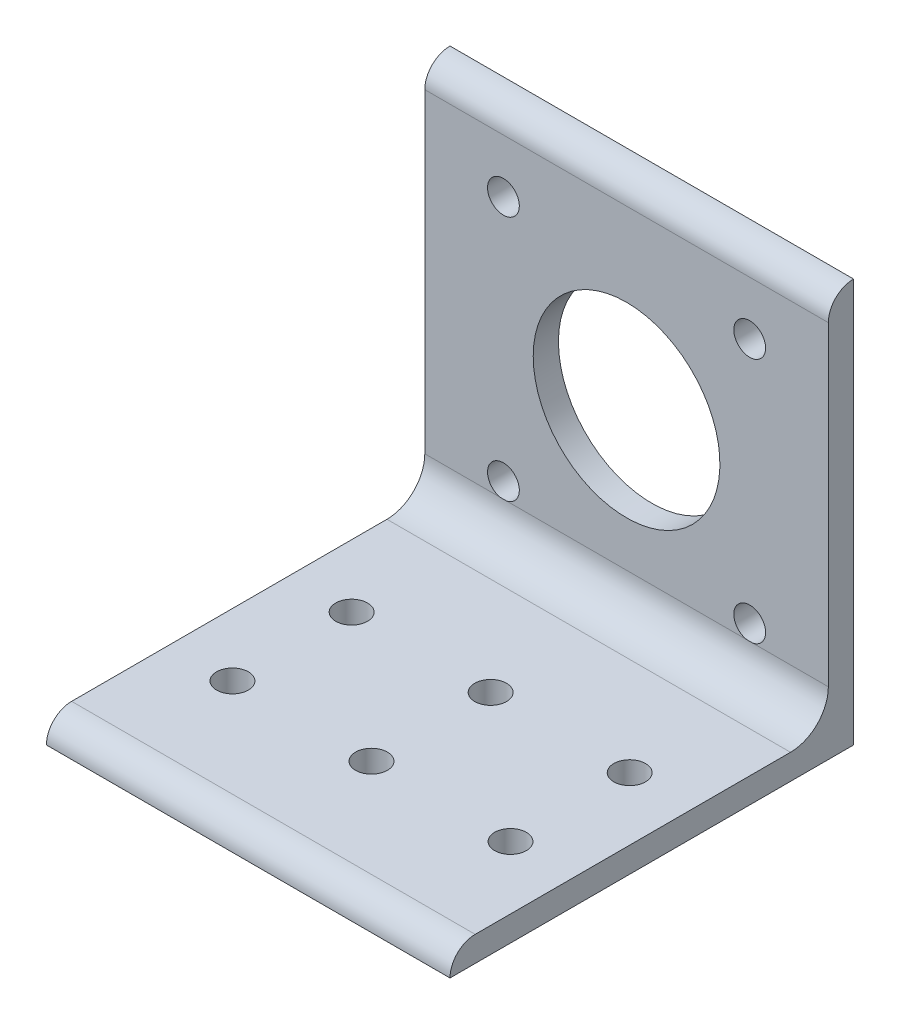
ISO-10303-21;
HEADER;
FILE_DESCRIPTION(('STEP AP214'),'2;1');
FILE_NAME('part.step','',(''),(''),'','','');
FILE_SCHEMA(('AUTOMOTIVE_DESIGN { 1 0 10303 214 1 1 1 1 }'));
ENDSEC;
DATA;
#1=APPLICATION_CONTEXT('core data for automotive mechanical design processes');
#2=APPLICATION_PROTOCOL_DEFINITION('international standard','automotive_design',2000,#1);
#3=PRODUCT_CONTEXT('',#1,'mechanical');
#4=PRODUCT('Part','Part','',(#3));
#5=PRODUCT_RELATED_PRODUCT_CATEGORY('part','',(#4));
#6=PRODUCT_DEFINITION_FORMATION('','',#4);
#7=PRODUCT_DEFINITION_CONTEXT('part definition',#1,'design');
#8=PRODUCT_DEFINITION('design','',#6,#7);
#9=PRODUCT_DEFINITION_SHAPE('','',#8);
#10=(LENGTH_UNIT() NAMED_UNIT(*) SI_UNIT(.MILLI.,.METRE.));
#11=(NAMED_UNIT(*) PLANE_ANGLE_UNIT() SI_UNIT($,.RADIAN.));
#12=(NAMED_UNIT(*) SI_UNIT($,.STERADIAN.) SOLID_ANGLE_UNIT());
#13=UNCERTAINTY_MEASURE_WITH_UNIT(LENGTH_MEASURE(1.E-05),#10,'distance_accuracy_value','');
#14=(GEOMETRIC_REPRESENTATION_CONTEXT(3) GLOBAL_UNCERTAINTY_ASSIGNED_CONTEXT((#13)) GLOBAL_UNIT_ASSIGNED_CONTEXT((#10,
#11,#12)) REPRESENTATION_CONTEXT('',''));
#15=CARTESIAN_POINT('',(0.,0.,0.));
#16=DIRECTION('',(0.,0.,1.));
#17=DIRECTION('',(1.,0.,0.));
#18=AXIS2_PLACEMENT_3D('',#15,#16,#17);
#19=CARTESIAN_POINT('',(25.4,50.8,0.));
#20=DIRECTION('',(0.,0.,1.));
#21=DIRECTION('',(1.,0.,0.));
#22=AXIS2_PLACEMENT_3D('',#19,#20,#21);
#23=PLANE('',#22);
#24=CARTESIAN_POINT('',(15.5,40.9,0.));
#25=DIRECTION('',(0.,0.,-1.));
#26=DIRECTION('',(-1.,0.,0.));
#27=AXIS2_PLACEMENT_3D('',#24,#25,#26);
#28=CIRCLE('',#27,2.);
#29=CARTESIAN_POINT('',(13.5,40.9,0.));
#30=VERTEX_POINT('',#29);
#31=EDGE_CURVE('E254',#30,#30,#28,.T.);
#32=ORIENTED_EDGE('',*,*,#31,.F.);
#33=EDGE_LOOP('',(#32));
#34=FACE_BOUND('',#33,.T.);
#35=CARTESIAN_POINT('',(-15.5,40.9,0.));
#36=DIRECTION('',(0.,0.,-1.));
#37=DIRECTION('',(-1.,0.,0.));
#38=AXIS2_PLACEMENT_3D('',#35,#36,#37);
#39=CIRCLE('',#38,2.);
#40=CARTESIAN_POINT('',(-17.5,40.9,0.));
#41=VERTEX_POINT('',#40);
#42=EDGE_CURVE('E247',#41,#41,#39,.T.);
#43=ORIENTED_EDGE('',*,*,#42,.F.);
#44=EDGE_LOOP('',(#43));
#45=FACE_BOUND('',#44,.T.);
#46=CARTESIAN_POINT('',(-15.5,9.9,0.));
#47=DIRECTION('',(0.,0.,-1.));
#48=DIRECTION('',(-1.,0.,0.));
#49=AXIS2_PLACEMENT_3D('',#46,#47,#48);
#50=CIRCLE('',#49,2.);
#51=CARTESIAN_POINT('',(-17.5,9.9,0.));
#52=VERTEX_POINT('',#51);
#53=EDGE_CURVE('E160',#52,#52,#50,.T.);
#54=ORIENTED_EDGE('',*,*,#53,.F.);
#55=EDGE_LOOP('',(#54));
#56=FACE_BOUND('',#55,.T.);
#57=CARTESIAN_POINT('',(15.5,9.9,0.));
#58=DIRECTION('',(0.,0.,-1.));
#59=DIRECTION('',(-1.,0.,0.));
#60=AXIS2_PLACEMENT_3D('',#57,#58,#59);
#61=CIRCLE('',#60,2.);
#62=CARTESIAN_POINT('',(13.5,9.9,0.));
#63=VERTEX_POINT('',#62);
#64=EDGE_CURVE('E169',#63,#63,#61,.T.);
#65=ORIENTED_EDGE('',*,*,#64,.F.);
#66=EDGE_LOOP('',(#65));
#67=FACE_BOUND('',#66,.T.);
#68=CARTESIAN_POINT('',(0.,25.4,0.));
#69=DIRECTION('',(0.,0.,-1.));
#70=DIRECTION('',(-1.,0.,0.));
#71=AXIS2_PLACEMENT_3D('',#68,#69,#70);
#72=CIRCLE('',#71,11.75);
#73=CARTESIAN_POINT('',(-11.75,25.4,0.));
#74=VERTEX_POINT('',#73);
#75=EDGE_CURVE('E239',#74,#74,#72,.T.);
#76=ORIENTED_EDGE('',*,*,#75,.F.);
#77=EDGE_LOOP('',(#76));
#78=FACE_BOUND('',#77,.T.);
#79=DIRECTION('',(0.,1.,0.));
#80=VECTOR('',#79,1.);
#81=CARTESIAN_POINT('',(-25.4,50.8,0.));
#82=LINE('',#81,#80);
#83=CARTESIAN_POINT('',(-25.4,0.,0.));
#84=VERTEX_POINT('',#83);
#85=CARTESIAN_POINT('',(-25.4,50.8,0.));
#86=VERTEX_POINT('',#85);
#87=EDGE_CURVE('E217',#84,#86,#82,.T.);
#88=ORIENTED_EDGE('',*,*,#87,.T.);
#89=DIRECTION('',(-1.,0.,0.));
#90=VECTOR('',#89,1.);
#91=CARTESIAN_POINT('',(25.4,50.8,0.));
#92=LINE('',#91,#90);
#93=CARTESIAN_POINT('',(25.4,50.8,0.));
#94=VERTEX_POINT('',#93);
#95=EDGE_CURVE('E13',#94,#86,#92,.T.);
#96=ORIENTED_EDGE('',*,*,#95,.F.);
#97=DIRECTION('',(0.,1.,0.));
#98=VECTOR('',#97,1.);
#99=CARTESIAN_POINT('',(25.4,50.8,0.));
#100=LINE('',#99,#98);
#101=CARTESIAN_POINT('',(25.4,0.,0.));
#102=VERTEX_POINT('',#101);
#103=EDGE_CURVE('E202',#102,#94,#100,.T.);
#104=ORIENTED_EDGE('',*,*,#103,.F.);
#105=DIRECTION('',(-1.,0.,0.));
#106=VECTOR('',#105,1.);
#107=CARTESIAN_POINT('',(25.4,0.,0.));
#108=LINE('',#107,#106);
#109=EDGE_CURVE('E196',#102,#84,#108,.T.);
#110=ORIENTED_EDGE('',*,*,#109,.T.);
#111=EDGE_LOOP('',(#88,#96,#104,#110));
#112=FACE_BOUND('',#111,.T.);
#113=ADVANCED_FACE('F66',(#34,#45,#56,#67,#78,#112),#23,.F.);
#114=CARTESIAN_POINT('',(25.4,50.8,0.00508));
#115=DIRECTION('',(0.,-1.,0.));
#116=DIRECTION('',(0.,0.,-1.));
#117=AXIS2_PLACEMENT_3D('',#114,#115,#116);
#118=PLANE('',#117);
#119=DIRECTION('',(0.,0.,1.));
#120=VECTOR('',#119,1.);
#121=CARTESIAN_POINT('',(-25.4,50.8,0.00508));
#122=LINE('',#121,#120);
#123=CARTESIAN_POINT('',(-25.4,50.8,0.00508000000000012));
#124=VERTEX_POINT('',#123);
#125=EDGE_CURVE('E215',#86,#124,#122,.T.);
#126=ORIENTED_EDGE('',*,*,#125,.T.);
#127=DIRECTION('',(-1.,0.,0.));
#128=VECTOR('',#127,1.);
#129=CARTESIAN_POINT('',(25.4,50.8,0.00508000000000012));
#130=LINE('',#129,#128);
#131=CARTESIAN_POINT('',(25.4,50.8,0.00508000000000012));
#132=VERTEX_POINT('',#131);
#133=EDGE_CURVE('E73',#132,#124,#130,.T.);
#134=ORIENTED_EDGE('',*,*,#133,.F.);
#135=DIRECTION('',(0.,0.,1.));
#136=VECTOR('',#135,1.);
#137=CARTESIAN_POINT('',(25.4,50.8,0.00508));
#138=LINE('',#137,#136);
#139=EDGE_CURVE('E233',#94,#132,#138,.T.);
#140=ORIENTED_EDGE('',*,*,#139,.F.);
#141=ORIENTED_EDGE('',*,*,#95,.T.);
#142=EDGE_LOOP('',(#126,#134,#140,#141));
#143=FACE_BOUND('',#142,.T.);
#144=ADVANCED_FACE('F345',(#143),#118,.F.);
#145=CARTESIAN_POINT('',(25.4,47.63008,0.00507999999999961));
#146=DIRECTION('',(-1.,0.,0.));
#147=DIRECTION('',(0.,0.,1.));
#148=AXIS2_PLACEMENT_3D('',#145,#146,#147);
#149=CYLINDRICAL_SURFACE('',#148,3.16992);
#150=CARTESIAN_POINT('',(-25.4,47.63008,0.00507999999999961));
#151=DIRECTION('',(1.,0.,0.));
#152=DIRECTION('',(0.,0.,-1.));
#153=AXIS2_PLACEMENT_3D('',#150,#151,#152);
#154=CIRCLE('',#153,3.16992);
#155=CARTESIAN_POINT('',(-25.4,47.63008,3.175));
#156=VERTEX_POINT('',#155);
#157=EDGE_CURVE('E213',#124,#156,#154,.T.);
#158=ORIENTED_EDGE('',*,*,#157,.T.);
#159=DIRECTION('',(-1.,0.,0.));
#160=VECTOR('',#159,1.);
#161=CARTESIAN_POINT('',(25.4,47.63008,3.175));
#162=LINE('',#161,#160);
#163=CARTESIAN_POINT('',(25.4,47.63008,3.175));
#164=VERTEX_POINT('',#163);
#165=EDGE_CURVE('E173',#164,#156,#162,.T.);
#166=ORIENTED_EDGE('',*,*,#165,.F.);
#167=CARTESIAN_POINT('',(25.4,47.63008,0.00507999999999961));
#168=DIRECTION('',(1.,0.,0.));
#169=DIRECTION('',(0.,0.,-1.));
#170=AXIS2_PLACEMENT_3D('',#167,#168,#169);
#171=CIRCLE('',#170,3.16992);
#172=EDGE_CURVE('E231',#132,#164,#171,.T.);
#173=ORIENTED_EDGE('',*,*,#172,.F.);
#174=ORIENTED_EDGE('',*,*,#133,.T.);
#175=EDGE_LOOP('',(#158,#166,#173,#174));
#176=FACE_BOUND('',#175,.T.);
#177=ADVANCED_FACE('F341',(#176),#149,.T.);
#178=CARTESIAN_POINT('',(25.4,7.93750000000001,3.17499999999999));
#179=DIRECTION('',(0.,0.,-1.));
#180=DIRECTION('',(0.,1.,0.));
#181=AXIS2_PLACEMENT_3D('',#178,#179,#180);
#182=PLANE('',#181);
#183=CARTESIAN_POINT('',(15.5,40.9,3.175));
#184=DIRECTION('',(0.,0.,-1.));
#185=DIRECTION('',(0.,1.,0.));
#186=AXIS2_PLACEMENT_3D('',#183,#184,#185);
#187=CIRCLE('',#186,2.);
#188=CARTESIAN_POINT('',(15.5,42.9,3.175));
#189=VERTEX_POINT('',#188);
#190=EDGE_CURVE('E241',#189,#189,#187,.F.);
#191=ORIENTED_EDGE('',*,*,#190,.F.);
#192=EDGE_LOOP('',(#191));
#193=FACE_BOUND('',#192,.T.);
#194=CARTESIAN_POINT('',(-15.5,40.9,3.175));
#195=DIRECTION('',(0.,0.,-1.));
#196=DIRECTION('',(0.,1.,0.));
#197=AXIS2_PLACEMENT_3D('',#194,#195,#196);
#198=CIRCLE('',#197,2.);
#199=CARTESIAN_POINT('',(-15.5,42.9,3.175));
#200=VERTEX_POINT('',#199);
#201=EDGE_CURVE('E251',#200,#200,#198,.F.);
#202=ORIENTED_EDGE('',*,*,#201,.F.);
#203=EDGE_LOOP('',(#202));
#204=FACE_BOUND('',#203,.T.);
#205=CARTESIAN_POINT('',(0.,25.4,3.17499999999999));
#206=DIRECTION('',(0.,0.,-1.));
#207=DIRECTION('',(0.,1.,0.));
#208=AXIS2_PLACEMENT_3D('',#205,#206,#207);
#209=CIRCLE('',#208,11.75);
#210=CARTESIAN_POINT('',(0.,37.15,3.17499999999999));
#211=VERTEX_POINT('',#210);
#212=EDGE_CURVE('E220',#211,#211,#209,.F.);
#213=ORIENTED_EDGE('',*,*,#212,.F.);
#214=EDGE_LOOP('',(#213));
#215=FACE_BOUND('',#214,.T.);
#216=DIRECTION('',(-1.,0.,0.));
#217=VECTOR('',#216,1.);
#218=CARTESIAN_POINT('',(25.4,7.93750000000001,3.17499999999999));
#219=LINE('',#218,#217);
#220=CARTESIAN_POINT('',(-15.8854785986278,7.93750000000001,3.17499999999999));
#221=VERTEX_POINT('',#220);
#222=CARTESIAN_POINT('',(-25.4,7.93750000000001,3.17499999999999));
#223=VERTEX_POINT('',#222);
#224=EDGE_CURVE('E174',#221,#223,#219,.T.);
#225=ORIENTED_EDGE('',*,*,#224,.F.);
#226=CARTESIAN_POINT('',(-15.5,9.9,3.17499999999999));
#227=DIRECTION('',(0.,0.,-1.));
#228=DIRECTION('',(0.,1.,0.));
#229=AXIS2_PLACEMENT_3D('',#226,#227,#228);
#230=CIRCLE('',#229,2.);
#231=CARTESIAN_POINT('',(-15.1145214013722,7.93750000000001,3.17499999999999));
#232=VERTEX_POINT('',#231);
#233=EDGE_CURVE('E248',#232,#221,#230,.F.);
#234=ORIENTED_EDGE('',*,*,#233,.F.);
#235=CARTESIAN_POINT('',(15.1145214013722,7.93750000000001,3.17499999999999));
#236=VERTEX_POINT('',#235);
#237=EDGE_CURVE('E152',#236,#232,#219,.T.);
#238=ORIENTED_EDGE('',*,*,#237,.F.);
#239=CARTESIAN_POINT('',(15.5,9.9,3.17499999999999));
#240=DIRECTION('',(0.,0.,-1.));
#241=DIRECTION('',(0.,1.,0.));
#242=AXIS2_PLACEMENT_3D('',#239,#240,#241);
#243=CIRCLE('',#242,2.);
#244=CARTESIAN_POINT('',(15.8854785986278,7.93750000000001,3.17499999999999));
#245=VERTEX_POINT('',#244);
#246=EDGE_CURVE('E158',#245,#236,#243,.F.);
#247=ORIENTED_EDGE('',*,*,#246,.F.);
#248=CARTESIAN_POINT('',(25.4,7.93750000000001,3.17499999999999));
#249=VERTEX_POINT('',#248);
#250=EDGE_CURVE('E151',#249,#245,#219,.T.);
#251=ORIENTED_EDGE('',*,*,#250,.F.);
#252=DIRECTION('',(0.,-1.,0.));
#253=VECTOR('',#252,1.);
#254=CARTESIAN_POINT('',(25.4,7.93750000000001,3.17499999999999));
#255=LINE('',#254,#253);
#256=EDGE_CURVE('E229',#164,#249,#255,.T.);
#257=ORIENTED_EDGE('',*,*,#256,.F.);
#258=ORIENTED_EDGE('',*,*,#165,.T.);
#259=DIRECTION('',(0.,-1.,0.));
#260=VECTOR('',#259,1.);
#261=CARTESIAN_POINT('',(-25.4,7.93750000000001,3.17499999999999));
#262=LINE('',#261,#260);
#263=EDGE_CURVE('E211',#156,#223,#262,.T.);
#264=ORIENTED_EDGE('',*,*,#263,.T.);
#265=EDGE_LOOP('',(#225,#234,#238,#247,#251,#257,#258,#264));
#266=FACE_BOUND('',#265,.T.);
#267=ADVANCED_FACE('F165',(#193,#204,#215,#266),#182,.F.);
#268=CARTESIAN_POINT('',(25.4,7.93750000000001,7.93749999999999));
#269=DIRECTION('',(-1.,0.,0.));
#270=DIRECTION('',(0.,0.,1.));
#271=AXIS2_PLACEMENT_3D('',#268,#269,#270);
#272=CYLINDRICAL_SURFACE('',#271,4.7625);
#273=CARTESIAN_POINT('',(-25.4,7.93750000000001,7.93749999999999));
#274=DIRECTION('',(-1.,0.,0.));
#275=DIRECTION('',(0.,0.,1.));
#276=AXIS2_PLACEMENT_3D('',#273,#274,#275);
#277=CIRCLE('',#276,4.7625);
#278=CARTESIAN_POINT('',(-25.4,3.17500000000001,7.93749999999999));
#279=VERTEX_POINT('',#278);
#280=EDGE_CURVE('E209',#223,#279,#277,.T.);
#281=ORIENTED_EDGE('',*,*,#280,.T.);
#282=DIRECTION('',(-1.,0.,0.));
#283=VECTOR('',#282,1.);
#284=CARTESIAN_POINT('',(25.4,3.17500000000001,7.93749999999999));
#285=LINE('',#284,#283);
#286=CARTESIAN_POINT('',(25.4,3.17500000000001,7.93749999999999));
#287=VERTEX_POINT('',#286);
#288=EDGE_CURVE('E179',#287,#279,#285,.T.);
#289=ORIENTED_EDGE('',*,*,#288,.F.);
#290=CARTESIAN_POINT('',(25.4,7.93750000000001,7.93749999999999));
#291=DIRECTION('',(-1.,0.,0.));
#292=DIRECTION('',(0.,0.,1.));
#293=AXIS2_PLACEMENT_3D('',#290,#291,#292);
#294=CIRCLE('',#293,4.7625);
#295=EDGE_CURVE('E172',#249,#287,#294,.T.);
#296=ORIENTED_EDGE('',*,*,#295,.F.);
#297=ORIENTED_EDGE('',*,*,#250,.T.);
#298=EDGE_CURVE('E146',#245,#236,#219,.T.);
#299=ORIENTED_EDGE('',*,*,#298,.T.);
#300=ORIENTED_EDGE('',*,*,#237,.T.);
#301=EDGE_CURVE('E178',#232,#221,#219,.T.);
#302=ORIENTED_EDGE('',*,*,#301,.T.);
#303=ORIENTED_EDGE('',*,*,#224,.T.);
#304=EDGE_LOOP('',(#281,#289,#296,#297,#299,#300,#302,#303));
#305=FACE_BOUND('',#304,.T.);
#306=ADVANCED_FACE('F170',(#305),#272,.F.);
#307=CARTESIAN_POINT('',(25.4,3.175,47.63008));
#308=DIRECTION('',(0.,-1.,0.));
#309=DIRECTION('',(0.,0.,-1.));
#310=AXIS2_PLACEMENT_3D('',#307,#308,#309);
#311=PLANE('',#310);
#312=CARTESIAN_POINT('',(17.5,3.17500000000001,20.28379));
#313=DIRECTION('',(0.,1.,0.));
#314=DIRECTION('',(0.,0.,1.));
#315=AXIS2_PLACEMENT_3D('',#312,#313,#314);
#316=CIRCLE('',#315,2.);
#317=CARTESIAN_POINT('',(17.5,3.17500000000001,22.28379));
#318=VERTEX_POINT('',#317);
#319=EDGE_CURVE('E289',#318,#318,#316,.T.);
#320=ORIENTED_EDGE('',*,*,#319,.F.);
#321=EDGE_LOOP('',(#320));
#322=FACE_BOUND('',#321,.T.);
#323=CARTESIAN_POINT('',(17.5,3.175,35.28379));
#324=DIRECTION('',(0.,1.,0.));
#325=DIRECTION('',(0.,0.,1.));
#326=AXIS2_PLACEMENT_3D('',#323,#324,#325);
#327=CIRCLE('',#326,2.);
#328=CARTESIAN_POINT('',(17.5,3.175,37.28379));
#329=VERTEX_POINT('',#328);
#330=EDGE_CURVE('E283',#329,#329,#327,.T.);
#331=ORIENTED_EDGE('',*,*,#330,.F.);
#332=EDGE_LOOP('',(#331));
#333=FACE_BOUND('',#332,.T.);
#334=CARTESIAN_POINT('',(-17.5,3.175,35.28379));
#335=DIRECTION('',(0.,1.,0.));
#336=DIRECTION('',(0.,0.,1.));
#337=AXIS2_PLACEMENT_3D('',#334,#335,#336);
#338=CIRCLE('',#337,2.);
#339=CARTESIAN_POINT('',(-17.5,3.175,37.28379));
#340=VERTEX_POINT('',#339);
#341=EDGE_CURVE('E277',#340,#340,#338,.T.);
#342=ORIENTED_EDGE('',*,*,#341,.F.);
#343=EDGE_LOOP('',(#342));
#344=FACE_BOUND('',#343,.T.);
#345=CARTESIAN_POINT('',(0.,3.17500000000001,20.28379));
#346=DIRECTION('',(0.,1.,0.));
#347=DIRECTION('',(0.,0.,1.));
#348=AXIS2_PLACEMENT_3D('',#345,#346,#347);
#349=CIRCLE('',#348,2.);
#350=CARTESIAN_POINT('',(0.,3.17500000000001,22.28379));
#351=VERTEX_POINT('',#350);
#352=EDGE_CURVE('E270',#351,#351,#349,.T.);
#353=ORIENTED_EDGE('',*,*,#352,.F.);
#354=EDGE_LOOP('',(#353));
#355=FACE_BOUND('',#354,.T.);
#356=CARTESIAN_POINT('',(0.,3.175,35.28379));
#357=DIRECTION('',(0.,1.,0.));
#358=DIRECTION('',(0.,0.,1.));
#359=AXIS2_PLACEMENT_3D('',#356,#357,#358);
#360=CIRCLE('',#359,2.);
#361=CARTESIAN_POINT('',(0.,3.175,37.28379));
#362=VERTEX_POINT('',#361);
#363=EDGE_CURVE('E271',#362,#362,#360,.T.);
#364=ORIENTED_EDGE('',*,*,#363,.F.);
#365=EDGE_LOOP('',(#364));
#366=FACE_BOUND('',#365,.T.);
#367=CARTESIAN_POINT('',(-17.5,3.17500000000001,20.28379));
#368=DIRECTION('',(0.,1.,0.));
#369=DIRECTION('',(0.,0.,1.));
#370=AXIS2_PLACEMENT_3D('',#367,#368,#369);
#371=CIRCLE('',#370,2.);
#372=CARTESIAN_POINT('',(-17.5,3.17500000000001,22.28379));
#373=VERTEX_POINT('',#372);
#374=EDGE_CURVE('E263',#373,#373,#371,.T.);
#375=ORIENTED_EDGE('',*,*,#374,.F.);
#376=EDGE_LOOP('',(#375));
#377=FACE_BOUND('',#376,.T.);
#378=DIRECTION('',(0.,0.,1.));
#379=VECTOR('',#378,1.);
#380=CARTESIAN_POINT('',(-25.4,3.175,47.63008));
#381=LINE('',#380,#379);
#382=CARTESIAN_POINT('',(-25.4,3.175,47.63008));
#383=VERTEX_POINT('',#382);
#384=EDGE_CURVE('E207',#279,#383,#381,.T.);
#385=ORIENTED_EDGE('',*,*,#384,.T.);
#386=DIRECTION('',(-1.,0.,0.));
#387=VECTOR('',#386,1.);
#388=CARTESIAN_POINT('',(25.4,3.175,47.63008));
#389=LINE('',#388,#387);
#390=CARTESIAN_POINT('',(25.4,3.175,47.63008));
#391=VERTEX_POINT('',#390);
#392=EDGE_CURVE('E183',#391,#383,#389,.T.);
#393=ORIENTED_EDGE('',*,*,#392,.F.);
#394=DIRECTION('',(0.,0.,1.));
#395=VECTOR('',#394,1.);
#396=CARTESIAN_POINT('',(25.4,3.175,47.63008));
#397=LINE('',#396,#395);
#398=EDGE_CURVE('E226',#287,#391,#397,.T.);
#399=ORIENTED_EDGE('',*,*,#398,.F.);
#400=ORIENTED_EDGE('',*,*,#288,.T.);
#401=EDGE_LOOP('',(#385,#393,#399,#400));
#402=FACE_BOUND('',#401,.T.);
#403=ADVANCED_FACE('F299',(#322,#333,#344,#355,#366,#377,#402),#311,.F.);
#404=CARTESIAN_POINT('',(25.4,0.00508000000000019,47.63008));
#405=DIRECTION('',(-1.,0.,0.));
#406=DIRECTION('',(0.,0.,1.));
#407=AXIS2_PLACEMENT_3D('',#404,#405,#406);
#408=CYLINDRICAL_SURFACE('',#407,3.16992);
#409=CARTESIAN_POINT('',(-25.4,0.00508000000000019,47.63008));
#410=DIRECTION('',(1.,0.,0.));
#411=DIRECTION('',(0.,0.,1.));
#412=AXIS2_PLACEMENT_3D('',#409,#410,#411);
#413=CIRCLE('',#412,3.16992);
#414=CARTESIAN_POINT('',(-25.4,0.00508,50.8));
#415=VERTEX_POINT('',#414);
#416=EDGE_CURVE('E205',#383,#415,#413,.T.);
#417=ORIENTED_EDGE('',*,*,#416,.T.);
#418=DIRECTION('',(-1.,0.,0.));
#419=VECTOR('',#418,1.);
#420=CARTESIAN_POINT('',(25.4,0.00508,50.8));
#421=LINE('',#420,#419);
#422=CARTESIAN_POINT('',(25.4,0.00508,50.8));
#423=VERTEX_POINT('',#422);
#424=EDGE_CURVE('E188',#423,#415,#421,.T.);
#425=ORIENTED_EDGE('',*,*,#424,.F.);
#426=CARTESIAN_POINT('',(25.4,0.00508000000000019,47.63008));
#427=DIRECTION('',(1.,0.,0.));
#428=DIRECTION('',(0.,0.,1.));
#429=AXIS2_PLACEMENT_3D('',#426,#427,#428);
#430=CIRCLE('',#429,3.16992);
#431=EDGE_CURVE('E224',#391,#423,#430,.T.);
#432=ORIENTED_EDGE('',*,*,#431,.F.);
#433=ORIENTED_EDGE('',*,*,#392,.T.);
#434=EDGE_LOOP('',(#417,#425,#432,#433));
#435=FACE_BOUND('',#434,.T.);
#436=ADVANCED_FACE('F302',(#435),#408,.T.);
#437=CARTESIAN_POINT('',(25.4,0.,50.8));
#438=DIRECTION('',(0.,0.,-1.));
#439=DIRECTION('',(-1.,0.,0.));
#440=AXIS2_PLACEMENT_3D('',#437,#438,#439);
#441=PLANE('',#440);
#442=DIRECTION('',(0.,-1.,0.));
#443=VECTOR('',#442,1.);
#444=CARTESIAN_POINT('',(-25.4,0.,50.8));
#445=LINE('',#444,#443);
#446=CARTESIAN_POINT('',(-25.4,0.,50.8));
#447=VERTEX_POINT('',#446);
#448=EDGE_CURVE('E203',#415,#447,#445,.T.);
#449=ORIENTED_EDGE('',*,*,#448,.T.);
#450=DIRECTION('',(-1.,0.,0.));
#451=VECTOR('',#450,1.);
#452=CARTESIAN_POINT('',(25.4,0.,50.8));
#453=LINE('',#452,#451);
#454=CARTESIAN_POINT('',(25.4,0.,50.8));
#455=VERTEX_POINT('',#454);
#456=EDGE_CURVE('E193',#455,#447,#453,.T.);
#457=ORIENTED_EDGE('',*,*,#456,.F.);
#458=DIRECTION('',(0.,-1.,0.));
#459=VECTOR('',#458,1.);
#460=CARTESIAN_POINT('',(25.4,0.,50.8));
#461=LINE('',#460,#459);
#462=EDGE_CURVE('E222',#423,#455,#461,.T.);
#463=ORIENTED_EDGE('',*,*,#462,.F.);
#464=ORIENTED_EDGE('',*,*,#424,.T.);
#465=EDGE_LOOP('',(#449,#457,#463,#464));
#466=FACE_BOUND('',#465,.T.);
#467=ADVANCED_FACE('F326',(#466),#441,.F.);
#468=CARTESIAN_POINT('',(25.4,0.,0.));
#469=DIRECTION('',(0.,1.,0.));
#470=DIRECTION('',(0.,0.,1.));
#471=AXIS2_PLACEMENT_3D('',#468,#469,#470);
#472=PLANE('',#471);
#473=CARTESIAN_POINT('',(17.5,0.,20.28379));
#474=DIRECTION('',(0.,1.,0.));
#475=DIRECTION('',(0.,0.,1.));
#476=AXIS2_PLACEMENT_3D('',#473,#474,#475);
#477=CIRCLE('',#476,2.);
#478=CARTESIAN_POINT('',(17.5,0.,22.28379));
#479=VERTEX_POINT('',#478);
#480=EDGE_CURVE('E266',#479,#479,#477,.F.);
#481=ORIENTED_EDGE('',*,*,#480,.F.);
#482=EDGE_LOOP('',(#481));
#483=FACE_BOUND('',#482,.T.);
#484=CARTESIAN_POINT('',(17.5,0.,35.28379));
#485=DIRECTION('',(0.,1.,0.));
#486=DIRECTION('',(0.,0.,1.));
#487=AXIS2_PLACEMENT_3D('',#484,#485,#486);
#488=CIRCLE('',#487,2.);
#489=CARTESIAN_POINT('',(17.5,0.,37.28379));
#490=VERTEX_POINT('',#489);
#491=EDGE_CURVE('E286',#490,#490,#488,.F.);
#492=ORIENTED_EDGE('',*,*,#491,.F.);
#493=EDGE_LOOP('',(#492));
#494=FACE_BOUND('',#493,.T.);
#495=CARTESIAN_POINT('',(-17.5,0.,35.28379));
#496=DIRECTION('',(0.,1.,0.));
#497=DIRECTION('',(0.,0.,1.));
#498=AXIS2_PLACEMENT_3D('',#495,#496,#497);
#499=CIRCLE('',#498,2.);
#500=CARTESIAN_POINT('',(-17.5,0.,37.28379));
#501=VERTEX_POINT('',#500);
#502=EDGE_CURVE('E280',#501,#501,#499,.F.);
#503=ORIENTED_EDGE('',*,*,#502,.F.);
#504=EDGE_LOOP('',(#503));
#505=FACE_BOUND('',#504,.T.);
#506=CARTESIAN_POINT('',(0.,0.,20.28379));
#507=DIRECTION('',(0.,1.,0.));
#508=DIRECTION('',(0.,0.,1.));
#509=AXIS2_PLACEMENT_3D('',#506,#507,#508);
#510=CIRCLE('',#509,2.);
#511=CARTESIAN_POINT('',(0.,0.,22.28379));
#512=VERTEX_POINT('',#511);
#513=EDGE_CURVE('E274',#512,#512,#510,.F.);
#514=ORIENTED_EDGE('',*,*,#513,.F.);
#515=EDGE_LOOP('',(#514));
#516=FACE_BOUND('',#515,.T.);
#517=CARTESIAN_POINT('',(0.,0.,35.28379));
#518=DIRECTION('',(0.,1.,0.));
#519=DIRECTION('',(0.,0.,1.));
#520=AXIS2_PLACEMENT_3D('',#517,#518,#519);
#521=CIRCLE('',#520,2.);
#522=CARTESIAN_POINT('',(0.,0.,37.28379));
#523=VERTEX_POINT('',#522);
#524=EDGE_CURVE('E267',#523,#523,#521,.F.);
#525=ORIENTED_EDGE('',*,*,#524,.F.);
#526=EDGE_LOOP('',(#525));
#527=FACE_BOUND('',#526,.T.);
#528=CARTESIAN_POINT('',(-17.5,0.,20.28379));
#529=DIRECTION('',(0.,1.,0.));
#530=DIRECTION('',(0.,0.,1.));
#531=AXIS2_PLACEMENT_3D('',#528,#529,#530);
#532=CIRCLE('',#531,2.);
#533=CARTESIAN_POINT('',(-17.5,0.,22.28379));
#534=VERTEX_POINT('',#533);
#535=EDGE_CURVE('E245',#534,#534,#532,.F.);
#536=ORIENTED_EDGE('',*,*,#535,.F.);
#537=EDGE_LOOP('',(#536));
#538=FACE_BOUND('',#537,.T.);
#539=DIRECTION('',(0.,0.,-1.));
#540=VECTOR('',#539,1.);
#541=CARTESIAN_POINT('',(-25.4,0.,0.));
#542=LINE('',#541,#540);
#543=EDGE_CURVE('E200',#447,#84,#542,.T.);
#544=ORIENTED_EDGE('',*,*,#543,.T.);
#545=ORIENTED_EDGE('',*,*,#109,.F.);
#546=DIRECTION('',(0.,0.,-1.));
#547=VECTOR('',#546,1.);
#548=CARTESIAN_POINT('',(25.4,0.,0.));
#549=LINE('',#548,#547);
#550=EDGE_CURVE('E199',#455,#102,#549,.T.);
#551=ORIENTED_EDGE('',*,*,#550,.F.);
#552=ORIENTED_EDGE('',*,*,#456,.T.);
#553=EDGE_LOOP('',(#544,#545,#551,#552));
#554=FACE_BOUND('',#553,.T.);
#555=ADVANCED_FACE('F330',(#483,#494,#505,#516,#527,#538,#554),#472,.F.);
#556=CARTESIAN_POINT('',(25.4,0.00508000000000019,47.63008));
#557=DIRECTION('',(-1.,0.,0.));
#558=DIRECTION('',(0.,0.,1.));
#559=AXIS2_PLACEMENT_3D('',#556,#557,#558);
#560=PLANE('',#559);
#561=ORIENTED_EDGE('',*,*,#103,.T.);
#562=ORIENTED_EDGE('',*,*,#139,.T.);
#563=ORIENTED_EDGE('',*,*,#172,.T.);
#564=ORIENTED_EDGE('',*,*,#256,.T.);
#565=ORIENTED_EDGE('',*,*,#295,.T.);
#566=ORIENTED_EDGE('',*,*,#398,.T.);
#567=ORIENTED_EDGE('',*,*,#431,.T.);
#568=ORIENTED_EDGE('',*,*,#462,.T.);
#569=ORIENTED_EDGE('',*,*,#550,.T.);
#570=EDGE_LOOP('',(#561,#562,#563,#564,#565,#566,#567,#568,#569));
#571=FACE_BOUND('',#570,.T.);
#572=ADVANCED_FACE('F334',(#571),#560,.F.);
#573=CARTESIAN_POINT('',(-25.4,0.00508000000000019,47.63008));
#574=DIRECTION('',(-1.,0.,0.));
#575=DIRECTION('',(0.,0.,1.));
#576=AXIS2_PLACEMENT_3D('',#573,#574,#575);
#577=PLANE('',#576);
#578=ORIENTED_EDGE('',*,*,#87,.F.);
#579=ORIENTED_EDGE('',*,*,#543,.F.);
#580=ORIENTED_EDGE('',*,*,#448,.F.);
#581=ORIENTED_EDGE('',*,*,#416,.F.);
#582=ORIENTED_EDGE('',*,*,#384,.F.);
#583=ORIENTED_EDGE('',*,*,#280,.F.);
#584=ORIENTED_EDGE('',*,*,#263,.F.);
#585=ORIENTED_EDGE('',*,*,#157,.F.);
#586=ORIENTED_EDGE('',*,*,#125,.F.);
#587=EDGE_LOOP('',(#578,#579,#580,#581,#582,#583,#584,#585,#586));
#588=FACE_BOUND('',#587,.T.);
#589=ADVANCED_FACE('F322',(#588),#577,.T.);
#590=CARTESIAN_POINT('',(0.,25.4,36.4090187157677));
#591=DIRECTION('',(0.,0.,-1.));
#592=DIRECTION('',(-1.,0.,0.));
#593=AXIS2_PLACEMENT_3D('',#590,#591,#592);
#594=CYLINDRICAL_SURFACE('',#593,11.75);
#595=ORIENTED_EDGE('',*,*,#212,.T.);
#596=EDGE_LOOP('',(#595));
#597=FACE_BOUND('',#596,.T.);
#598=ORIENTED_EDGE('',*,*,#75,.T.);
#599=EDGE_LOOP('',(#598));
#600=FACE_BOUND('',#599,.T.);
#601=ADVANCED_FACE('F362',(#597,#600),#594,.F.);
#602=CARTESIAN_POINT('',(25.4,7.93750000000001,3.17499999999999));
#603=DIRECTION('',(0.,0.,-1.));
#604=DIRECTION('',(0.,1.,0.));
#605=AXIS2_PLACEMENT_3D('',#602,#603,#604);
#606=PLANE('',#605);
#607=ORIENTED_EDGE('',*,*,#298,.F.);
#608=EDGE_CURVE('E86',#236,#245,#243,.F.);
#609=ORIENTED_EDGE('',*,*,#608,.F.);
#610=EDGE_LOOP('',(#607,#609));
#611=FACE_BOUND('',#610,.T.);
#612=ADVANCED_FACE('F147',(#611),#606,.T.);
#613=CARTESIAN_POINT('',(15.5,9.9,36.4090187157677));
#614=DIRECTION('',(0.,0.,-1.));
#615=DIRECTION('',(-1.,0.,0.));
#616=AXIS2_PLACEMENT_3D('',#613,#614,#615);
#617=CYLINDRICAL_SURFACE('',#616,2.);
#618=ORIENTED_EDGE('',*,*,#608,.T.);
#619=ORIENTED_EDGE('',*,*,#246,.T.);
#620=EDGE_LOOP('',(#618,#619));
#621=FACE_BOUND('',#620,.T.);
#622=ORIENTED_EDGE('',*,*,#64,.T.);
#623=EDGE_LOOP('',(#622));
#624=FACE_BOUND('',#623,.T.);
#625=ADVANCED_FACE('F156',(#621,#624),#617,.F.);
#626=CARTESIAN_POINT('',(25.4,7.93750000000001,3.17499999999999));
#627=DIRECTION('',(0.,0.,-1.));
#628=DIRECTION('',(0.,1.,0.));
#629=AXIS2_PLACEMENT_3D('',#626,#627,#628);
#630=PLANE('',#629);
#631=ORIENTED_EDGE('',*,*,#301,.F.);
#632=EDGE_CURVE('E79',#221,#232,#230,.F.);
#633=ORIENTED_EDGE('',*,*,#632,.F.);
#634=EDGE_LOOP('',(#631,#633));
#635=FACE_BOUND('',#634,.T.);
#636=ADVANCED_FACE('F492',(#635),#630,.T.);
#637=CARTESIAN_POINT('',(-15.5,9.9,36.4090187157677));
#638=DIRECTION('',(0.,0.,-1.));
#639=DIRECTION('',(-1.,0.,0.));
#640=AXIS2_PLACEMENT_3D('',#637,#638,#639);
#641=CYLINDRICAL_SURFACE('',#640,2.);
#642=ORIENTED_EDGE('',*,*,#632,.T.);
#643=ORIENTED_EDGE('',*,*,#233,.T.);
#644=EDGE_LOOP('',(#642,#643));
#645=FACE_BOUND('',#644,.T.);
#646=ORIENTED_EDGE('',*,*,#53,.T.);
#647=EDGE_LOOP('',(#646));
#648=FACE_BOUND('',#647,.T.);
#649=ADVANCED_FACE('F499',(#645,#648),#641,.F.);
#650=CARTESIAN_POINT('',(-15.5,40.9,36.4090187157677));
#651=DIRECTION('',(0.,0.,-1.));
#652=DIRECTION('',(-1.,0.,0.));
#653=AXIS2_PLACEMENT_3D('',#650,#651,#652);
#654=CYLINDRICAL_SURFACE('',#653,2.);
#655=ORIENTED_EDGE('',*,*,#201,.T.);
#656=EDGE_LOOP('',(#655));
#657=FACE_BOUND('',#656,.T.);
#658=ORIENTED_EDGE('',*,*,#42,.T.);
#659=EDGE_LOOP('',(#658));
#660=FACE_BOUND('',#659,.T.);
#661=ADVANCED_FACE('F507',(#657,#660),#654,.F.);
#662=CARTESIAN_POINT('',(15.5,40.9,36.4090187157677));
#663=DIRECTION('',(0.,0.,-1.));
#664=DIRECTION('',(-1.,0.,0.));
#665=AXIS2_PLACEMENT_3D('',#662,#663,#664);
#666=CYLINDRICAL_SURFACE('',#665,2.);
#667=ORIENTED_EDGE('',*,*,#190,.T.);
#668=EDGE_LOOP('',(#667));
#669=FACE_BOUND('',#668,.T.);
#670=ORIENTED_EDGE('',*,*,#31,.T.);
#671=EDGE_LOOP('',(#670));
#672=FACE_BOUND('',#671,.T.);
#673=ADVANCED_FACE('F516',(#669,#672),#666,.F.);
#674=CARTESIAN_POINT('',(-17.5,-5.65685424949238,20.28379));
#675=DIRECTION('',(0.,1.,0.));
#676=DIRECTION('',(0.,0.,1.));
#677=AXIS2_PLACEMENT_3D('',#674,#675,#676);
#678=CYLINDRICAL_SURFACE('',#677,2.);
#679=ORIENTED_EDGE('',*,*,#535,.T.);
#680=EDGE_LOOP('',(#679));
#681=FACE_BOUND('',#680,.T.);
#682=ORIENTED_EDGE('',*,*,#374,.T.);
#683=EDGE_LOOP('',(#682));
#684=FACE_BOUND('',#683,.T.);
#685=ADVANCED_FACE('F524',(#681,#684),#678,.F.);
#686=CARTESIAN_POINT('',(0.,-5.65685424949239,35.28379));
#687=DIRECTION('',(0.,1.,0.));
#688=DIRECTION('',(0.,0.,1.));
#689=AXIS2_PLACEMENT_3D('',#686,#687,#688);
#690=CYLINDRICAL_SURFACE('',#689,2.);
#691=ORIENTED_EDGE('',*,*,#524,.T.);
#692=EDGE_LOOP('',(#691));
#693=FACE_BOUND('',#692,.T.);
#694=ORIENTED_EDGE('',*,*,#363,.T.);
#695=EDGE_LOOP('',(#694));
#696=FACE_BOUND('',#695,.T.);
#697=ADVANCED_FACE('F532',(#693,#696),#690,.F.);
#698=CARTESIAN_POINT('',(0.,-5.65685424949238,20.28379));
#699=DIRECTION('',(0.,1.,0.));
#700=DIRECTION('',(0.,0.,1.));
#701=AXIS2_PLACEMENT_3D('',#698,#699,#700);
#702=CYLINDRICAL_SURFACE('',#701,2.);
#703=ORIENTED_EDGE('',*,*,#513,.T.);
#704=EDGE_LOOP('',(#703));
#705=FACE_BOUND('',#704,.T.);
#706=ORIENTED_EDGE('',*,*,#352,.T.);
#707=EDGE_LOOP('',(#706));
#708=FACE_BOUND('',#707,.T.);
#709=ADVANCED_FACE('F541',(#705,#708),#702,.F.);
#710=CARTESIAN_POINT('',(-17.5,-5.65685424949239,35.28379));
#711=DIRECTION('',(0.,1.,0.));
#712=DIRECTION('',(0.,0.,1.));
#713=AXIS2_PLACEMENT_3D('',#710,#711,#712);
#714=CYLINDRICAL_SURFACE('',#713,2.);
#715=ORIENTED_EDGE('',*,*,#502,.T.);
#716=EDGE_LOOP('',(#715));
#717=FACE_BOUND('',#716,.T.);
#718=ORIENTED_EDGE('',*,*,#341,.T.);
#719=EDGE_LOOP('',(#718));
#720=FACE_BOUND('',#719,.T.);
#721=ADVANCED_FACE('F550',(#717,#720),#714,.F.);
#722=CARTESIAN_POINT('',(17.5,-5.65685424949239,35.28379));
#723=DIRECTION('',(0.,1.,0.));
#724=DIRECTION('',(0.,0.,1.));
#725=AXIS2_PLACEMENT_3D('',#722,#723,#724);
#726=CYLINDRICAL_SURFACE('',#725,2.);
#727=ORIENTED_EDGE('',*,*,#491,.T.);
#728=EDGE_LOOP('',(#727));
#729=FACE_BOUND('',#728,.T.);
#730=ORIENTED_EDGE('',*,*,#330,.T.);
#731=EDGE_LOOP('',(#730));
#732=FACE_BOUND('',#731,.T.);
#733=ADVANCED_FACE('F559',(#729,#732),#726,.F.);
#734=CARTESIAN_POINT('',(17.5,-5.65685424949238,20.28379));
#735=DIRECTION('',(0.,1.,0.));
#736=DIRECTION('',(0.,0.,1.));
#737=AXIS2_PLACEMENT_3D('',#734,#735,#736);
#738=CYLINDRICAL_SURFACE('',#737,2.);
#739=ORIENTED_EDGE('',*,*,#480,.T.);
#740=EDGE_LOOP('',(#739));
#741=FACE_BOUND('',#740,.T.);
#742=ORIENTED_EDGE('',*,*,#319,.T.);
#743=EDGE_LOOP('',(#742));
#744=FACE_BOUND('',#743,.T.);
#745=ADVANCED_FACE('F297',(#741,#744),#738,.F.);
#746=CLOSED_SHELL('',(#113,#144,#177,#267,#306,#403,#436,#467,#555,#572,#589,#601,#612,#625,
#636,#649,#661,#673,#685,#697,#709,#721,#733,#745));
#747=MANIFOLD_SOLID_BREP('B2',#746);
#748=ADVANCED_BREP_SHAPE_REPRESENTATION('',(#18,#747),#14);
#749=SHAPE_DEFINITION_REPRESENTATION(#9,#748);
ENDSEC;
END-ISO-10303-21;
